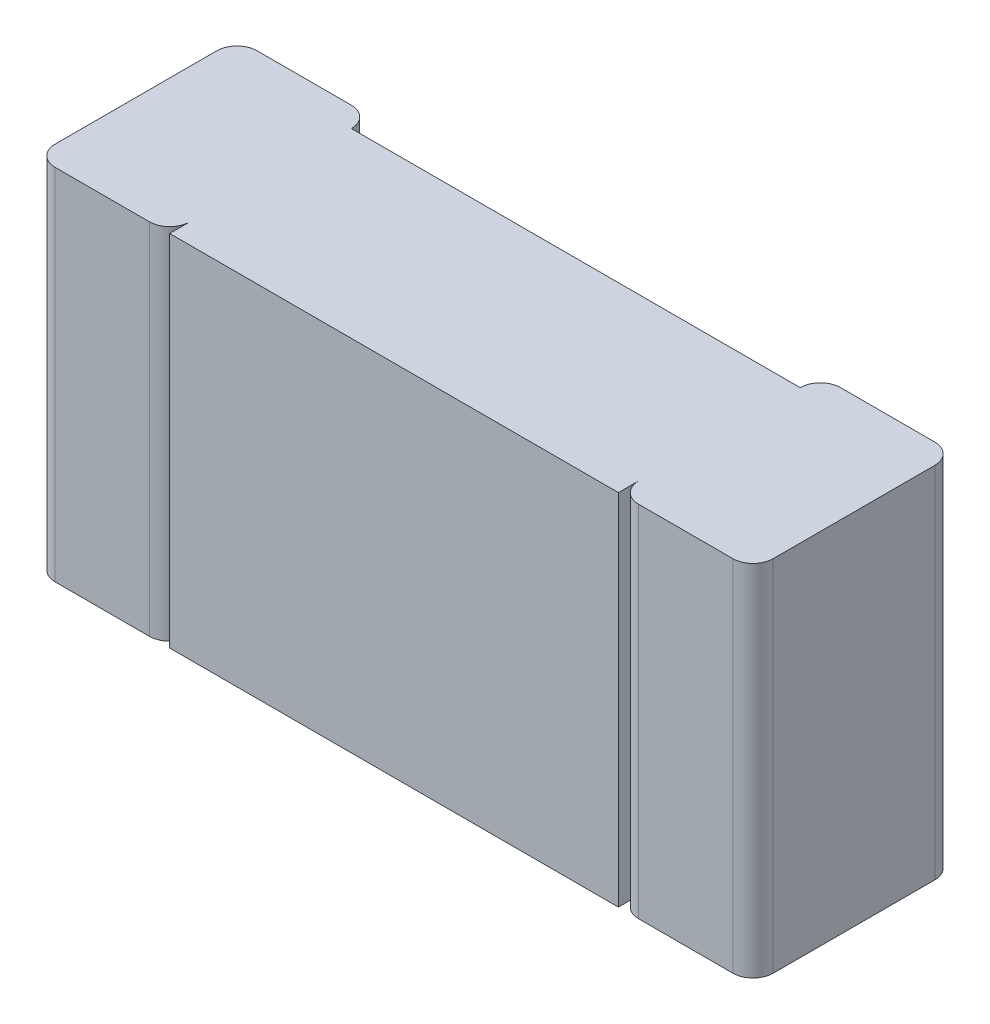
ISO-10303-21;
HEADER;
FILE_DESCRIPTION(('STEP AP214'),'2;1');
FILE_NAME('part.step','',(''),(''),'','','');
FILE_SCHEMA(('AUTOMOTIVE_DESIGN { 1 0 10303 214 1 1 1 1 }'));
ENDSEC;
DATA;
#1=APPLICATION_CONTEXT('core data for automotive mechanical design processes');
#2=APPLICATION_PROTOCOL_DEFINITION('international standard','automotive_design',2000,#1);
#3=PRODUCT_CONTEXT('',#1,'mechanical');
#4=PRODUCT('Part','Part','',(#3));
#5=PRODUCT_RELATED_PRODUCT_CATEGORY('part','',(#4));
#6=PRODUCT_DEFINITION_FORMATION('','',#4);
#7=PRODUCT_DEFINITION_CONTEXT('part definition',#1,'design');
#8=PRODUCT_DEFINITION('design','',#6,#7);
#9=PRODUCT_DEFINITION_SHAPE('','',#8);
#10=(LENGTH_UNIT() NAMED_UNIT(*) SI_UNIT(.MILLI.,.METRE.));
#11=(NAMED_UNIT(*) PLANE_ANGLE_UNIT() SI_UNIT($,.RADIAN.));
#12=(NAMED_UNIT(*) SI_UNIT($,.STERADIAN.) SOLID_ANGLE_UNIT());
#13=UNCERTAINTY_MEASURE_WITH_UNIT(LENGTH_MEASURE(1.E-05),#10,'distance_accuracy_value','');
#14=(GEOMETRIC_REPRESENTATION_CONTEXT(3) GLOBAL_UNCERTAINTY_ASSIGNED_CONTEXT((#13)) GLOBAL_UNIT_ASSIGNED_CONTEXT((#10,
#11,#12)) REPRESENTATION_CONTEXT('',''));
#15=CARTESIAN_POINT('',(0.,0.,0.));
#16=DIRECTION('',(0.,0.,1.));
#17=DIRECTION('',(1.,0.,0.));
#18=AXIS2_PLACEMENT_3D('',#15,#16,#17);
#19=CARTESIAN_POINT('',(-0.755,-0.4,0.045));
#20=DIRECTION('',(0.,1.,0.));
#21=DIRECTION('',(0.,0.,1.));
#22=AXIS2_PLACEMENT_3D('',#19,#20,#21);
#23=CYLINDRICAL_SURFACE('',#22,0.0450000000000016);
#24=DIRECTION('',(0.,-1.,0.));
#25=VECTOR('',#24,1.);
#26=CARTESIAN_POINT('',(-0.755,0.,0.));
#27=LINE('',#26,#25);
#28=CARTESIAN_POINT('',(-0.755,0.4,0.));
#29=VERTEX_POINT('',#28);
#30=CARTESIAN_POINT('',(-0.755,-0.4,0.));
#31=VERTEX_POINT('',#30);
#32=EDGE_CURVE('E130',#29,#31,#27,.T.);
#33=ORIENTED_EDGE('',*,*,#32,.T.);
#34=CARTESIAN_POINT('',(-0.755,-0.4,0.045));
#35=DIRECTION('',(0.,1.,0.));
#36=DIRECTION('',(0.,0.,1.));
#37=AXIS2_PLACEMENT_3D('',#34,#35,#36);
#38=CIRCLE('',#37,0.0450000000000016);
#39=CARTESIAN_POINT('',(-0.8,-0.4,0.045));
#40=VERTEX_POINT('',#39);
#41=EDGE_CURVE('E21',#31,#40,#38,.T.);
#42=ORIENTED_EDGE('',*,*,#41,.T.);
#43=DIRECTION('',(0.,1.,0.));
#44=VECTOR('',#43,1.);
#45=CARTESIAN_POINT('',(-0.8,0.,0.045));
#46=LINE('',#45,#44);
#47=CARTESIAN_POINT('',(-0.8,0.4,0.045));
#48=VERTEX_POINT('',#47);
#49=EDGE_CURVE('E137',#40,#48,#46,.T.);
#50=ORIENTED_EDGE('',*,*,#49,.T.);
#51=CARTESIAN_POINT('',(-0.755,0.4,0.045));
#52=DIRECTION('',(0.,1.,0.));
#53=DIRECTION('',(0.,0.,1.));
#54=AXIS2_PLACEMENT_3D('',#51,#52,#53);
#55=CIRCLE('',#54,0.0450000000000016);
#56=EDGE_CURVE('E233',#29,#48,#55,.T.);
#57=ORIENTED_EDGE('',*,*,#56,.F.);
#58=EDGE_LOOP('',(#33,#42,#50,#57));
#59=FACE_BOUND('',#58,.T.);
#60=ADVANCED_FACE('F17',(#59),#23,.T.);
#61=CARTESIAN_POINT('',(-0.8,0.4,0.045));
#62=DIRECTION('',(1.,0.,0.));
#63=DIRECTION('',(0.,0.,1.));
#64=AXIS2_PLACEMENT_3D('',#61,#62,#63);
#65=PLANE('',#64);
#66=DIRECTION('',(0.,0.,1.));
#67=VECTOR('',#66,1.);
#68=CARTESIAN_POINT('',(-0.8,0.4,0.225));
#69=LINE('',#68,#67);
#70=CARTESIAN_POINT('',(-0.8,0.4,0.405));
#71=VERTEX_POINT('',#70);
#72=EDGE_CURVE('E142',#48,#71,#69,.T.);
#73=ORIENTED_EDGE('',*,*,#72,.F.);
#74=ORIENTED_EDGE('',*,*,#49,.F.);
#75=DIRECTION('',(0.,0.,1.));
#76=VECTOR('',#75,1.);
#77=CARTESIAN_POINT('',(-0.8,-0.4,0.225));
#78=LINE('',#77,#76);
#79=CARTESIAN_POINT('',(-0.8,-0.4,0.405));
#80=VERTEX_POINT('',#79);
#81=EDGE_CURVE('E141',#40,#80,#78,.T.);
#82=ORIENTED_EDGE('',*,*,#81,.T.);
#83=DIRECTION('',(0.,-1.,0.));
#84=VECTOR('',#83,1.);
#85=CARTESIAN_POINT('',(-0.8,0.,0.405));
#86=LINE('',#85,#84);
#87=EDGE_CURVE('E143',#71,#80,#86,.T.);
#88=ORIENTED_EDGE('',*,*,#87,.F.);
#89=EDGE_LOOP('',(#73,#74,#82,#88));
#90=FACE_BOUND('',#89,.T.);
#91=ADVANCED_FACE('F139',(#90),#65,.F.);
#92=CARTESIAN_POINT('',(-0.755,-0.4,0.405));
#93=DIRECTION('',(0.,1.,0.));
#94=DIRECTION('',(0.,0.,1.));
#95=AXIS2_PLACEMENT_3D('',#92,#93,#94);
#96=CYLINDRICAL_SURFACE('',#95,0.0450000000000016);
#97=CARTESIAN_POINT('',(-0.755,0.4,0.405));
#98=DIRECTION('',(0.,1.,0.));
#99=DIRECTION('',(0.,0.,1.));
#100=AXIS2_PLACEMENT_3D('',#97,#98,#99);
#101=CIRCLE('',#100,0.0450000000000016);
#102=CARTESIAN_POINT('',(-0.755,0.4,0.45));
#103=VERTEX_POINT('',#102);
#104=EDGE_CURVE('E231',#71,#103,#101,.T.);
#105=ORIENTED_EDGE('',*,*,#104,.F.);
#106=ORIENTED_EDGE('',*,*,#87,.T.);
#107=CARTESIAN_POINT('',(-0.755,-0.4,0.405));
#108=DIRECTION('',(0.,1.,0.));
#109=DIRECTION('',(0.,0.,1.));
#110=AXIS2_PLACEMENT_3D('',#107,#108,#109);
#111=CIRCLE('',#110,0.0450000000000016);
#112=CARTESIAN_POINT('',(-0.755,-0.4,0.45));
#113=VERTEX_POINT('',#112);
#114=EDGE_CURVE('E152',#80,#113,#111,.T.);
#115=ORIENTED_EDGE('',*,*,#114,.T.);
#116=DIRECTION('',(0.,-1.,0.));
#117=VECTOR('',#116,1.);
#118=CARTESIAN_POINT('',(-0.755,0.,0.45));
#119=LINE('',#118,#117);
#120=EDGE_CURVE('E201',#103,#113,#119,.T.);
#121=ORIENTED_EDGE('',*,*,#120,.F.);
#122=EDGE_LOOP('',(#105,#106,#115,#121));
#123=FACE_BOUND('',#122,.T.);
#124=ADVANCED_FACE('F452',(#123),#96,.T.);
#125=CARTESIAN_POINT('',(-0.755,-0.4,0.45));
#126=DIRECTION('',(0.,0.,1.));
#127=DIRECTION('',(1.,0.,0.));
#128=AXIS2_PLACEMENT_3D('',#125,#126,#127);
#129=PLANE('',#128);
#130=DIRECTION('',(1.,0.,0.));
#131=VECTOR('',#130,1.);
#132=CARTESIAN_POINT('',(-0.65,-0.4,0.45));
#133=LINE('',#132,#131);
#134=CARTESIAN_POINT('',(-0.545,-0.4,0.45));
#135=VERTEX_POINT('',#134);
#136=EDGE_CURVE('E249',#113,#135,#133,.T.);
#137=ORIENTED_EDGE('',*,*,#136,.T.);
#138=DIRECTION('',(0.,-1.,0.));
#139=VECTOR('',#138,1.);
#140=CARTESIAN_POINT('',(-0.545,0.,0.45));
#141=LINE('',#140,#139);
#142=CARTESIAN_POINT('',(-0.545,0.4,0.45));
#143=VERTEX_POINT('',#142);
#144=EDGE_CURVE('E199',#143,#135,#141,.T.);
#145=ORIENTED_EDGE('',*,*,#144,.F.);
#146=DIRECTION('',(1.,0.,0.));
#147=VECTOR('',#146,1.);
#148=CARTESIAN_POINT('',(-0.65,0.4,0.45));
#149=LINE('',#148,#147);
#150=EDGE_CURVE('E230',#103,#143,#149,.T.);
#151=ORIENTED_EDGE('',*,*,#150,.F.);
#152=ORIENTED_EDGE('',*,*,#120,.T.);
#153=EDGE_LOOP('',(#137,#145,#151,#152));
#154=FACE_BOUND('',#153,.T.);
#155=ADVANCED_FACE('F442',(#154),#129,.T.);
#156=CARTESIAN_POINT('',(-0.545,-0.4,0.405));
#157=DIRECTION('',(0.,1.,0.));
#158=DIRECTION('',(0.,0.,1.));
#159=AXIS2_PLACEMENT_3D('',#156,#157,#158);
#160=CYLINDRICAL_SURFACE('',#159,0.0450000000000017);
#161=ORIENTED_EDGE('',*,*,#144,.T.);
#162=CARTESIAN_POINT('',(-0.545,-0.4,0.405));
#163=DIRECTION('',(0.,1.,0.));
#164=DIRECTION('',(0.,0.,1.));
#165=AXIS2_PLACEMENT_3D('',#162,#163,#164);
#166=CIRCLE('',#165,0.0450000000000017);
#167=CARTESIAN_POINT('',(-0.499999999999999,-0.4,0.405));
#168=VERTEX_POINT('',#167);
#169=EDGE_CURVE('E247',#135,#168,#166,.T.);
#170=ORIENTED_EDGE('',*,*,#169,.T.);
#171=DIRECTION('',(0.,1.,0.));
#172=VECTOR('',#171,1.);
#173=CARTESIAN_POINT('',(-0.5,0.,0.405));
#174=LINE('',#173,#172);
#175=CARTESIAN_POINT('',(-0.499999999999999,0.4,0.405));
#176=VERTEX_POINT('',#175);
#177=EDGE_CURVE('E194',#168,#176,#174,.T.);
#178=ORIENTED_EDGE('',*,*,#177,.T.);
#179=CARTESIAN_POINT('',(-0.545,0.4,0.405));
#180=DIRECTION('',(0.,1.,0.));
#181=DIRECTION('',(0.,0.,1.));
#182=AXIS2_PLACEMENT_3D('',#179,#180,#181);
#183=CIRCLE('',#182,0.0450000000000017);
#184=EDGE_CURVE('E228',#143,#176,#183,.T.);
#185=ORIENTED_EDGE('',*,*,#184,.F.);
#186=EDGE_LOOP('',(#161,#170,#178,#185));
#187=FACE_BOUND('',#186,.T.);
#188=ADVANCED_FACE('F430',(#187),#160,.T.);
#189=CARTESIAN_POINT('',(-0.5,0.4,0.405));
#190=DIRECTION('',(1.,0.,0.));
#191=DIRECTION('',(0.,0.,1.));
#192=AXIS2_PLACEMENT_3D('',#189,#190,#191);
#193=PLANE('',#192);
#194=DIRECTION('',(0.,0.,1.));
#195=VECTOR('',#194,1.);
#196=CARTESIAN_POINT('',(-0.5,0.4,0.4275));
#197=LINE('',#196,#195);
#198=CARTESIAN_POINT('',(-0.5,0.4,0.45));
#199=VERTEX_POINT('',#198);
#200=EDGE_CURVE('E189',#176,#199,#197,.T.);
#201=ORIENTED_EDGE('',*,*,#200,.F.);
#202=ORIENTED_EDGE('',*,*,#177,.F.);
#203=DIRECTION('',(0.,0.,1.));
#204=VECTOR('',#203,1.);
#205=CARTESIAN_POINT('',(-0.5,-0.4,0.4275));
#206=LINE('',#205,#204);
#207=CARTESIAN_POINT('',(-0.5,-0.4,0.45));
#208=VERTEX_POINT('',#207);
#209=EDGE_CURVE('E207',#168,#208,#206,.T.);
#210=ORIENTED_EDGE('',*,*,#209,.T.);
#211=DIRECTION('',(0.,-1.,0.));
#212=VECTOR('',#211,1.);
#213=CARTESIAN_POINT('',(-0.5,0.,0.45));
#214=LINE('',#213,#212);
#215=EDGE_CURVE('E182',#199,#208,#214,.T.);
#216=ORIENTED_EDGE('',*,*,#215,.F.);
#217=EDGE_LOOP('',(#201,#202,#210,#216));
#218=FACE_BOUND('',#217,.T.);
#219=ADVANCED_FACE('F420',(#218),#193,.F.);
#220=CARTESIAN_POINT('',(-0.5,-0.4,0.45));
#221=DIRECTION('',(0.,0.,1.));
#222=DIRECTION('',(1.,0.,0.));
#223=AXIS2_PLACEMENT_3D('',#220,#221,#222);
#224=PLANE('',#223);
#225=DIRECTION('',(0.,-1.,0.));
#226=VECTOR('',#225,1.);
#227=CARTESIAN_POINT('',(0.5,0.,0.45));
#228=LINE('',#227,#226);
#229=CARTESIAN_POINT('',(0.5,0.4,0.45));
#230=VERTEX_POINT('',#229);
#231=CARTESIAN_POINT('',(0.5,-0.4,0.45));
#232=VERTEX_POINT('',#231);
#233=EDGE_CURVE('E175',#230,#232,#228,.T.);
#234=ORIENTED_EDGE('',*,*,#233,.F.);
#235=DIRECTION('',(1.,0.,0.));
#236=VECTOR('',#235,1.);
#237=CARTESIAN_POINT('',(0.,0.4,0.45));
#238=LINE('',#237,#236);
#239=EDGE_CURVE('E185',#199,#230,#238,.T.);
#240=ORIENTED_EDGE('',*,*,#239,.F.);
#241=ORIENTED_EDGE('',*,*,#215,.T.);
#242=DIRECTION('',(1.,0.,0.));
#243=VECTOR('',#242,1.);
#244=CARTESIAN_POINT('',(0.,-0.4,0.45));
#245=LINE('',#244,#243);
#246=EDGE_CURVE('E204',#208,#232,#245,.T.);
#247=ORIENTED_EDGE('',*,*,#246,.T.);
#248=EDGE_LOOP('',(#234,#240,#241,#247));
#249=FACE_BOUND('',#248,.T.);
#250=ADVANCED_FACE('F407',(#249),#224,.T.);
#251=CARTESIAN_POINT('',(0.5,0.4,0.405));
#252=DIRECTION('',(1.,0.,0.));
#253=DIRECTION('',(0.,0.,1.));
#254=AXIS2_PLACEMENT_3D('',#251,#252,#253);
#255=PLANE('',#254);
#256=DIRECTION('',(0.,0.,-1.));
#257=VECTOR('',#256,1.);
#258=CARTESIAN_POINT('',(0.5,0.4,0.4275));
#259=LINE('',#258,#257);
#260=CARTESIAN_POINT('',(0.499999999999999,0.4,0.405));
#261=VERTEX_POINT('',#260);
#262=EDGE_CURVE('E188',#230,#261,#259,.T.);
#263=ORIENTED_EDGE('',*,*,#262,.F.);
#264=ORIENTED_EDGE('',*,*,#233,.T.);
#265=DIRECTION('',(0.,0.,-1.));
#266=VECTOR('',#265,1.);
#267=CARTESIAN_POINT('',(0.5,-0.4,0.4275));
#268=LINE('',#267,#266);
#269=CARTESIAN_POINT('',(0.499999999999999,-0.4,0.405));
#270=VERTEX_POINT('',#269);
#271=EDGE_CURVE('E179',#232,#270,#268,.T.);
#272=ORIENTED_EDGE('',*,*,#271,.T.);
#273=DIRECTION('',(0.,-1.,0.));
#274=VECTOR('',#273,1.);
#275=CARTESIAN_POINT('',(0.5,0.,0.405));
#276=LINE('',#275,#274);
#277=EDGE_CURVE('E173',#261,#270,#276,.T.);
#278=ORIENTED_EDGE('',*,*,#277,.F.);
#279=EDGE_LOOP('',(#263,#264,#272,#278));
#280=FACE_BOUND('',#279,.T.);
#281=ADVANCED_FACE('F375',(#280),#255,.T.);
#282=CARTESIAN_POINT('',(0.545,-0.4,0.405));
#283=DIRECTION('',(0.,1.,0.));
#284=DIRECTION('',(0.,0.,1.));
#285=AXIS2_PLACEMENT_3D('',#282,#283,#284);
#286=CYLINDRICAL_SURFACE('',#285,0.0450000000000017);
#287=CARTESIAN_POINT('',(0.545,0.4,0.405));
#288=DIRECTION('',(0.,1.,0.));
#289=DIRECTION('',(0.,0.,1.));
#290=AXIS2_PLACEMENT_3D('',#287,#288,#289);
#291=CIRCLE('',#290,0.0450000000000017);
#292=CARTESIAN_POINT('',(0.545,0.4,0.45));
#293=VERTEX_POINT('',#292);
#294=EDGE_CURVE('E225',#261,#293,#291,.T.);
#295=ORIENTED_EDGE('',*,*,#294,.F.);
#296=ORIENTED_EDGE('',*,*,#277,.T.);
#297=CARTESIAN_POINT('',(0.545,-0.4,0.405));
#298=DIRECTION('',(0.,1.,0.));
#299=DIRECTION('',(0.,0.,1.));
#300=AXIS2_PLACEMENT_3D('',#297,#298,#299);
#301=CIRCLE('',#300,0.0450000000000017);
#302=CARTESIAN_POINT('',(0.545,-0.4,0.45));
#303=VERTEX_POINT('',#302);
#304=EDGE_CURVE('E244',#270,#303,#301,.T.);
#305=ORIENTED_EDGE('',*,*,#304,.T.);
#306=DIRECTION('',(0.,-1.,0.));
#307=VECTOR('',#306,1.);
#308=CARTESIAN_POINT('',(0.545,0.,0.45));
#309=LINE('',#308,#307);
#310=EDGE_CURVE('E171',#293,#303,#309,.T.);
#311=ORIENTED_EDGE('',*,*,#310,.F.);
#312=EDGE_LOOP('',(#295,#296,#305,#311));
#313=FACE_BOUND('',#312,.T.);
#314=ADVANCED_FACE('F406',(#313),#286,.T.);
#315=CARTESIAN_POINT('',(0.545,-0.4,0.45));
#316=DIRECTION('',(0.,0.,1.));
#317=DIRECTION('',(1.,0.,0.));
#318=AXIS2_PLACEMENT_3D('',#315,#316,#317);
#319=PLANE('',#318);
#320=DIRECTION('',(1.,0.,0.));
#321=VECTOR('',#320,1.);
#322=CARTESIAN_POINT('',(0.65,-0.4,0.45));
#323=LINE('',#322,#321);
#324=CARTESIAN_POINT('',(0.755,-0.4,0.45));
#325=VERTEX_POINT('',#324);
#326=EDGE_CURVE('E243',#303,#325,#323,.T.);
#327=ORIENTED_EDGE('',*,*,#326,.T.);
#328=DIRECTION('',(0.,-1.,0.));
#329=VECTOR('',#328,1.);
#330=CARTESIAN_POINT('',(0.755,0.,0.45));
#331=LINE('',#330,#329);
#332=CARTESIAN_POINT('',(0.755,0.4,0.45));
#333=VERTEX_POINT('',#332);
#334=EDGE_CURVE('E169',#333,#325,#331,.T.);
#335=ORIENTED_EDGE('',*,*,#334,.F.);
#336=DIRECTION('',(1.,0.,0.));
#337=VECTOR('',#336,1.);
#338=CARTESIAN_POINT('',(0.65,0.4,0.45));
#339=LINE('',#338,#337);
#340=EDGE_CURVE('E224',#293,#333,#339,.T.);
#341=ORIENTED_EDGE('',*,*,#340,.F.);
#342=ORIENTED_EDGE('',*,*,#310,.T.);
#343=EDGE_LOOP('',(#327,#335,#341,#342));
#344=FACE_BOUND('',#343,.T.);
#345=ADVANCED_FACE('F485',(#344),#319,.T.);
#346=CARTESIAN_POINT('',(0.755,-0.4,0.405));
#347=DIRECTION('',(0.,1.,0.));
#348=DIRECTION('',(0.,0.,1.));
#349=AXIS2_PLACEMENT_3D('',#346,#347,#348);
#350=CYLINDRICAL_SURFACE('',#349,0.0450000000000016);
#351=ORIENTED_EDGE('',*,*,#334,.T.);
#352=CARTESIAN_POINT('',(0.755,-0.4,0.405));
#353=DIRECTION('',(0.,1.,0.));
#354=DIRECTION('',(0.,0.,1.));
#355=AXIS2_PLACEMENT_3D('',#352,#353,#354);
#356=CIRCLE('',#355,0.0450000000000016);
#357=CARTESIAN_POINT('',(0.8,-0.4,0.405));
#358=VERTEX_POINT('',#357);
#359=EDGE_CURVE('E240',#325,#358,#356,.T.);
#360=ORIENTED_EDGE('',*,*,#359,.T.);
#361=DIRECTION('',(0.,-1.,0.));
#362=VECTOR('',#361,1.);
#363=CARTESIAN_POINT('',(0.8,0.,0.405));
#364=LINE('',#363,#362);
#365=CARTESIAN_POINT('',(0.8,0.4,0.405));
#366=VERTEX_POINT('',#365);
#367=EDGE_CURVE('E167',#366,#358,#364,.T.);
#368=ORIENTED_EDGE('',*,*,#367,.F.);
#369=CARTESIAN_POINT('',(0.755,0.4,0.405));
#370=DIRECTION('',(0.,1.,0.));
#371=DIRECTION('',(0.,0.,1.));
#372=AXIS2_PLACEMENT_3D('',#369,#370,#371);
#373=CIRCLE('',#372,0.0450000000000016);
#374=EDGE_CURVE('E222',#333,#366,#373,.T.);
#375=ORIENTED_EDGE('',*,*,#374,.F.);
#376=EDGE_LOOP('',(#351,#360,#368,#375));
#377=FACE_BOUND('',#376,.T.);
#378=ADVANCED_FACE('F489',(#377),#350,.T.);
#379=CARTESIAN_POINT('',(0.8,0.4,0.045));
#380=DIRECTION('',(1.,0.,0.));
#381=DIRECTION('',(0.,0.,1.));
#382=AXIS2_PLACEMENT_3D('',#379,#380,#381);
#383=PLANE('',#382);
#384=DIRECTION('',(0.,0.,-1.));
#385=VECTOR('',#384,1.);
#386=CARTESIAN_POINT('',(0.8,0.4,0.225));
#387=LINE('',#386,#385);
#388=CARTESIAN_POINT('',(0.8,0.4,0.045));
#389=VERTEX_POINT('',#388);
#390=EDGE_CURVE('E221',#366,#389,#387,.T.);
#391=ORIENTED_EDGE('',*,*,#390,.F.);
#392=ORIENTED_EDGE('',*,*,#367,.T.);
#393=DIRECTION('',(0.,0.,-1.));
#394=VECTOR('',#393,1.);
#395=CARTESIAN_POINT('',(0.8,-0.4,0.225));
#396=LINE('',#395,#394);
#397=CARTESIAN_POINT('',(0.8,-0.4,0.045));
#398=VERTEX_POINT('',#397);
#399=EDGE_CURVE('E239',#358,#398,#396,.T.);
#400=ORIENTED_EDGE('',*,*,#399,.T.);
#401=DIRECTION('',(0.,-1.,0.));
#402=VECTOR('',#401,1.);
#403=CARTESIAN_POINT('',(0.8,0.,0.045));
#404=LINE('',#403,#402);
#405=EDGE_CURVE('E158',#389,#398,#404,.T.);
#406=ORIENTED_EDGE('',*,*,#405,.F.);
#407=EDGE_LOOP('',(#391,#392,#400,#406));
#408=FACE_BOUND('',#407,.T.);
#409=ADVANCED_FACE('F299',(#408),#383,.T.);
#410=CARTESIAN_POINT('',(0.755,-0.4,0.045));
#411=DIRECTION('',(0.,1.,0.));
#412=DIRECTION('',(0.,0.,1.));
#413=AXIS2_PLACEMENT_3D('',#410,#411,#412);
#414=CYLINDRICAL_SURFACE('',#413,0.0450000000000016);
#415=CARTESIAN_POINT('',(0.755,0.4,0.045));
#416=DIRECTION('',(0.,1.,0.));
#417=DIRECTION('',(0.,0.,1.));
#418=AXIS2_PLACEMENT_3D('',#415,#416,#417);
#419=CIRCLE('',#418,0.0450000000000016);
#420=CARTESIAN_POINT('',(0.755,0.4,0.));
#421=VERTEX_POINT('',#420);
#422=EDGE_CURVE('E218',#389,#421,#419,.T.);
#423=ORIENTED_EDGE('',*,*,#422,.F.);
#424=ORIENTED_EDGE('',*,*,#405,.T.);
#425=CARTESIAN_POINT('',(0.755,-0.4,0.045));
#426=DIRECTION('',(0.,1.,0.));
#427=DIRECTION('',(0.,0.,1.));
#428=AXIS2_PLACEMENT_3D('',#425,#426,#427);
#429=CIRCLE('',#428,0.0450000000000016);
#430=CARTESIAN_POINT('',(0.755,-0.4,0.));
#431=VERTEX_POINT('',#430);
#432=EDGE_CURVE('E236',#398,#431,#429,.T.);
#433=ORIENTED_EDGE('',*,*,#432,.T.);
#434=DIRECTION('',(0.,1.,0.));
#435=VECTOR('',#434,1.);
#436=CARTESIAN_POINT('',(0.755,0.,0.));
#437=LINE('',#436,#435);
#438=EDGE_CURVE('E176',#431,#421,#437,.T.);
#439=ORIENTED_EDGE('',*,*,#438,.T.);
#440=EDGE_LOOP('',(#423,#424,#433,#439));
#441=FACE_BOUND('',#440,.T.);
#442=ADVANCED_FACE('F303',(#441),#414,.T.);
#443=CARTESIAN_POINT('',(-0.755,-0.4,0.));
#444=DIRECTION('',(0.,0.,1.));
#445=DIRECTION('',(1.,0.,0.));
#446=AXIS2_PLACEMENT_3D('',#443,#444,#445);
#447=PLANE('',#446);
#448=DIRECTION('',(-1.,0.,0.));
#449=VECTOR('',#448,1.);
#450=CARTESIAN_POINT('',(-0.65,-0.4,0.));
#451=LINE('',#450,#449);
#452=CARTESIAN_POINT('',(-0.545,-0.4,0.));
#453=VERTEX_POINT('',#452);
#454=EDGE_CURVE('E154',#453,#31,#451,.T.);
#455=ORIENTED_EDGE('',*,*,#454,.T.);
#456=ORIENTED_EDGE('',*,*,#32,.F.);
#457=DIRECTION('',(-1.,0.,0.));
#458=VECTOR('',#457,1.);
#459=CARTESIAN_POINT('',(-0.65,0.4,0.));
#460=LINE('',#459,#458);
#461=CARTESIAN_POINT('',(-0.545,0.4,0.));
#462=VERTEX_POINT('',#461);
#463=EDGE_CURVE('E235',#462,#29,#460,.T.);
#464=ORIENTED_EDGE('',*,*,#463,.F.);
#465=DIRECTION('',(0.,1.,0.));
#466=VECTOR('',#465,1.);
#467=CARTESIAN_POINT('',(-0.545,0.,0.));
#468=LINE('',#467,#466);
#469=EDGE_CURVE('E162',#453,#462,#468,.T.);
#470=ORIENTED_EDGE('',*,*,#469,.F.);
#471=EDGE_LOOP('',(#455,#456,#464,#470));
#472=FACE_BOUND('',#471,.T.);
#473=ADVANCED_FACE('F319',(#472),#447,.F.);
#474=CARTESIAN_POINT('',(0.545,-0.4,0.));
#475=DIRECTION('',(0.,0.,1.));
#476=DIRECTION('',(1.,0.,0.));
#477=AXIS2_PLACEMENT_3D('',#474,#475,#476);
#478=PLANE('',#477);
#479=DIRECTION('',(-1.,0.,0.));
#480=VECTOR('',#479,1.);
#481=CARTESIAN_POINT('',(0.65,-0.4,0.));
#482=LINE('',#481,#480);
#483=CARTESIAN_POINT('',(0.545,-0.4,0.));
#484=VERTEX_POINT('',#483);
#485=EDGE_CURVE('E178',#431,#484,#482,.T.);
#486=ORIENTED_EDGE('',*,*,#485,.T.);
#487=DIRECTION('',(0.,-1.,0.));
#488=VECTOR('',#487,1.);
#489=CARTESIAN_POINT('',(0.545,0.,0.));
#490=LINE('',#489,#488);
#491=CARTESIAN_POINT('',(0.545,0.4,0.));
#492=VERTEX_POINT('',#491);
#493=EDGE_CURVE('E213',#492,#484,#490,.T.);
#494=ORIENTED_EDGE('',*,*,#493,.F.);
#495=DIRECTION('',(-1.,0.,0.));
#496=VECTOR('',#495,1.);
#497=CARTESIAN_POINT('',(0.65,0.4,0.));
#498=LINE('',#497,#496);
#499=EDGE_CURVE('E227',#421,#492,#498,.T.);
#500=ORIENTED_EDGE('',*,*,#499,.F.);
#501=ORIENTED_EDGE('',*,*,#438,.F.);
#502=EDGE_LOOP('',(#486,#494,#500,#501));
#503=FACE_BOUND('',#502,.T.);
#504=ADVANCED_FACE('F306',(#503),#478,.F.);
#505=CARTESIAN_POINT('',(-0.545,-0.4,0.045));
#506=DIRECTION('',(0.,1.,0.));
#507=DIRECTION('',(0.,0.,1.));
#508=AXIS2_PLACEMENT_3D('',#505,#506,#507);
#509=CYLINDRICAL_SURFACE('',#508,0.0450000000000016);
#510=CARTESIAN_POINT('',(-0.545,0.4,0.045));
#511=DIRECTION('',(0.,1.,0.));
#512=DIRECTION('',(0.,0.,1.));
#513=AXIS2_PLACEMENT_3D('',#510,#511,#512);
#514=CIRCLE('',#513,0.0450000000000016);
#515=CARTESIAN_POINT('',(-0.499999999999999,0.4,0.045));
#516=VERTEX_POINT('',#515);
#517=EDGE_CURVE('E164',#462,#516,#514,.F.);
#518=ORIENTED_EDGE('',*,*,#517,.T.);
#519=DIRECTION('',(0.,-1.,0.));
#520=VECTOR('',#519,1.);
#521=CARTESIAN_POINT('',(-0.5,0.,0.045));
#522=LINE('',#521,#520);
#523=CARTESIAN_POINT('',(-0.499999999999999,-0.4,0.045));
#524=VERTEX_POINT('',#523);
#525=EDGE_CURVE('E212',#516,#524,#522,.T.);
#526=ORIENTED_EDGE('',*,*,#525,.T.);
#527=CARTESIAN_POINT('',(-0.545,-0.4,0.045));
#528=DIRECTION('',(0.,1.,0.));
#529=DIRECTION('',(0.,0.,1.));
#530=AXIS2_PLACEMENT_3D('',#527,#528,#529);
#531=CIRCLE('',#530,0.0450000000000016);
#532=EDGE_CURVE('E165',#524,#453,#531,.T.);
#533=ORIENTED_EDGE('',*,*,#532,.T.);
#534=ORIENTED_EDGE('',*,*,#469,.T.);
#535=EDGE_LOOP('',(#518,#526,#533,#534));
#536=FACE_BOUND('',#535,.T.);
#537=ADVANCED_FACE('F318',(#536),#509,.T.);
#538=CARTESIAN_POINT('',(-0.755,-0.4,0.045));
#539=DIRECTION('',(0.,1.,0.));
#540=DIRECTION('',(0.,0.,1.));
#541=AXIS2_PLACEMENT_3D('',#538,#539,#540);
#542=PLANE('',#541);
#543=DIRECTION('',(1.,0.,0.));
#544=VECTOR('',#543,1.);
#545=CARTESIAN_POINT('',(0.,-0.4,0.045));
#546=LINE('',#545,#544);
#547=CARTESIAN_POINT('',(0.499999999999999,-0.4,0.045));
#548=VERTEX_POINT('',#547);
#549=EDGE_CURVE('E264',#524,#548,#546,.T.);
#550=ORIENTED_EDGE('',*,*,#549,.T.);
#551=CARTESIAN_POINT('',(0.545,-0.4,0.045));
#552=DIRECTION('',(0.,1.,0.));
#553=DIRECTION('',(0.,0.,1.));
#554=AXIS2_PLACEMENT_3D('',#551,#552,#553);
#555=CIRCLE('',#554,0.0450000000000016);
#556=EDGE_CURVE('E210',#484,#548,#555,.T.);
#557=ORIENTED_EDGE('',*,*,#556,.F.);
#558=ORIENTED_EDGE('',*,*,#485,.F.);
#559=ORIENTED_EDGE('',*,*,#432,.F.);
#560=ORIENTED_EDGE('',*,*,#399,.F.);
#561=ORIENTED_EDGE('',*,*,#359,.F.);
#562=ORIENTED_EDGE('',*,*,#326,.F.);
#563=ORIENTED_EDGE('',*,*,#304,.F.);
#564=ORIENTED_EDGE('',*,*,#271,.F.);
#565=ORIENTED_EDGE('',*,*,#246,.F.);
#566=ORIENTED_EDGE('',*,*,#209,.F.);
#567=ORIENTED_EDGE('',*,*,#169,.F.);
#568=ORIENTED_EDGE('',*,*,#136,.F.);
#569=ORIENTED_EDGE('',*,*,#114,.F.);
#570=ORIENTED_EDGE('',*,*,#81,.F.);
#571=ORIENTED_EDGE('',*,*,#41,.F.);
#572=ORIENTED_EDGE('',*,*,#454,.F.);
#573=ORIENTED_EDGE('',*,*,#532,.F.);
#574=EDGE_LOOP('',(#550,#557,#558,#559,#560,#561,#562,#563,#564,#565,#566,#567,#568,#569,#570,
#571,#572,#573));
#575=FACE_BOUND('',#574,.T.);
#576=ADVANCED_FACE('F148',(#575),#542,.F.);
#577=CARTESIAN_POINT('',(0.545,-0.4,0.045));
#578=DIRECTION('',(0.,1.,0.));
#579=DIRECTION('',(0.,0.,1.));
#580=AXIS2_PLACEMENT_3D('',#577,#578,#579);
#581=CYLINDRICAL_SURFACE('',#580,0.0450000000000016);
#582=ORIENTED_EDGE('',*,*,#493,.T.);
#583=ORIENTED_EDGE('',*,*,#556,.T.);
#584=DIRECTION('',(0.,1.,0.));
#585=VECTOR('',#584,1.);
#586=CARTESIAN_POINT('',(0.5,0.,0.045));
#587=LINE('',#586,#585);
#588=CARTESIAN_POINT('',(0.499999999999999,0.4,0.045));
#589=VERTEX_POINT('',#588);
#590=EDGE_CURVE('E27',#548,#589,#587,.T.);
#591=ORIENTED_EDGE('',*,*,#590,.T.);
#592=CARTESIAN_POINT('',(0.545,0.4,0.045));
#593=DIRECTION('',(0.,1.,0.));
#594=DIRECTION('',(0.,0.,1.));
#595=AXIS2_PLACEMENT_3D('',#592,#593,#594);
#596=CIRCLE('',#595,0.0450000000000016);
#597=EDGE_CURVE('E35',#589,#492,#596,.F.);
#598=ORIENTED_EDGE('',*,*,#597,.T.);
#599=EDGE_LOOP('',(#582,#583,#591,#598));
#600=FACE_BOUND('',#599,.T.);
#601=ADVANCED_FACE('F312',(#600),#581,.T.);
#602=CARTESIAN_POINT('',(-0.755,0.4,0.045));
#603=DIRECTION('',(0.,1.,0.));
#604=DIRECTION('',(0.,0.,1.));
#605=AXIS2_PLACEMENT_3D('',#602,#603,#604);
#606=PLANE('',#605);
#607=DIRECTION('',(-1.,0.,0.));
#608=VECTOR('',#607,1.);
#609=CARTESIAN_POINT('',(0.,0.4,0.045));
#610=LINE('',#609,#608);
#611=EDGE_CURVE('E11',#589,#516,#610,.T.);
#612=ORIENTED_EDGE('',*,*,#611,.T.);
#613=ORIENTED_EDGE('',*,*,#517,.F.);
#614=ORIENTED_EDGE('',*,*,#463,.T.);
#615=ORIENTED_EDGE('',*,*,#56,.T.);
#616=ORIENTED_EDGE('',*,*,#72,.T.);
#617=ORIENTED_EDGE('',*,*,#104,.T.);
#618=ORIENTED_EDGE('',*,*,#150,.T.);
#619=ORIENTED_EDGE('',*,*,#184,.T.);
#620=ORIENTED_EDGE('',*,*,#200,.T.);
#621=ORIENTED_EDGE('',*,*,#239,.T.);
#622=ORIENTED_EDGE('',*,*,#262,.T.);
#623=ORIENTED_EDGE('',*,*,#294,.T.);
#624=ORIENTED_EDGE('',*,*,#340,.T.);
#625=ORIENTED_EDGE('',*,*,#374,.T.);
#626=ORIENTED_EDGE('',*,*,#390,.T.);
#627=ORIENTED_EDGE('',*,*,#422,.T.);
#628=ORIENTED_EDGE('',*,*,#499,.T.);
#629=ORIENTED_EDGE('',*,*,#597,.F.);
#630=EDGE_LOOP('',(#612,#613,#614,#615,#616,#617,#618,#619,#620,#621,#622,#623,#624,#625,#626,
#627,#628,#629));
#631=FACE_BOUND('',#630,.T.);
#632=ADVANCED_FACE('F293',(#631),#606,.T.);
#633=CARTESIAN_POINT('',(-0.5,-0.4,0.045));
#634=DIRECTION('',(0.,0.,1.));
#635=DIRECTION('',(1.,0.,0.));
#636=AXIS2_PLACEMENT_3D('',#633,#634,#635);
#637=PLANE('',#636);
#638=ORIENTED_EDGE('',*,*,#590,.F.);
#639=ORIENTED_EDGE('',*,*,#549,.F.);
#640=ORIENTED_EDGE('',*,*,#525,.F.);
#641=ORIENTED_EDGE('',*,*,#611,.F.);
#642=EDGE_LOOP('',(#638,#639,#640,#641));
#643=FACE_BOUND('',#642,.T.);
#644=ADVANCED_FACE('F19',(#643),#637,.F.);
#645=CLOSED_SHELL('',(#60,#91,#124,#155,#188,#219,#250,#281,#314,#345,#378,#409,#442,#473,#504,
#537,#576,#601,#632,#644));
#646=MANIFOLD_SOLID_BREP('B1',#645);
#647=ADVANCED_BREP_SHAPE_REPRESENTATION('',(#18,#646),#14);
#648=SHAPE_DEFINITION_REPRESENTATION(#9,#647);
ENDSEC;
END-ISO-10303-21;
